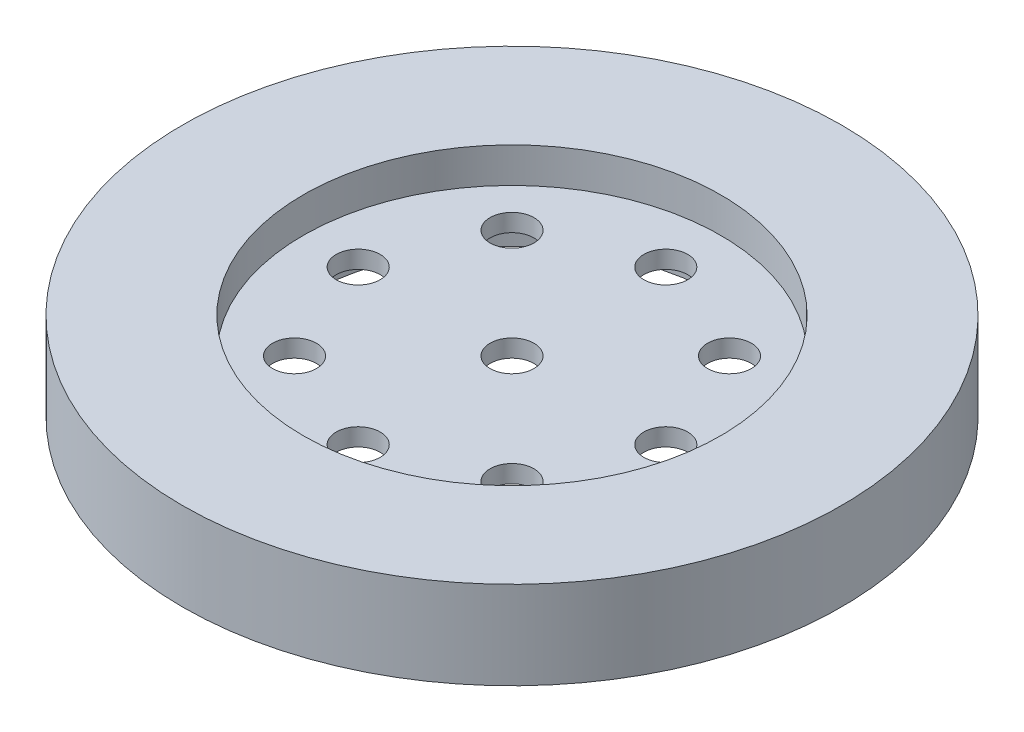
ISO-10303-21;
HEADER;
FILE_DESCRIPTION(('STEP AP214'),'2;1');
FILE_NAME('part.step','',(''),(''),'','','');
FILE_SCHEMA(('AUTOMOTIVE_DESIGN { 1 0 10303 214 1 1 1 1 }'));
ENDSEC;
DATA;
#1=APPLICATION_CONTEXT('core data for automotive mechanical design processes');
#2=APPLICATION_PROTOCOL_DEFINITION('international standard','automotive_design',2000,#1);
#3=PRODUCT_CONTEXT('',#1,'mechanical');
#4=PRODUCT('Part','Part','',(#3));
#5=PRODUCT_RELATED_PRODUCT_CATEGORY('part','',(#4));
#6=PRODUCT_DEFINITION_FORMATION('','',#4);
#7=PRODUCT_DEFINITION_CONTEXT('part definition',#1,'design');
#8=PRODUCT_DEFINITION('design','',#6,#7);
#9=PRODUCT_DEFINITION_SHAPE('','',#8);
#10=(LENGTH_UNIT() NAMED_UNIT(*) SI_UNIT(.MILLI.,.METRE.));
#11=(NAMED_UNIT(*) PLANE_ANGLE_UNIT() SI_UNIT($,.RADIAN.));
#12=(NAMED_UNIT(*) SI_UNIT($,.STERADIAN.) SOLID_ANGLE_UNIT());
#13=UNCERTAINTY_MEASURE_WITH_UNIT(LENGTH_MEASURE(1.E-05),#10,'distance_accuracy_value','');
#14=(GEOMETRIC_REPRESENTATION_CONTEXT(3) GLOBAL_UNCERTAINTY_ASSIGNED_CONTEXT((#13)) GLOBAL_UNIT_ASSIGNED_CONTEXT((#10,
#11,#12)) REPRESENTATION_CONTEXT('',''));
#15=CARTESIAN_POINT('',(0.,0.,0.));
#16=DIRECTION('',(0.,0.,1.));
#17=DIRECTION('',(1.,0.,0.));
#18=AXIS2_PLACEMENT_3D('',#15,#16,#17);
#19=CARTESIAN_POINT('',(0.,0.,0.));
#20=DIRECTION('',(0.,1.,0.));
#21=DIRECTION('',(0.,0.,1.));
#22=AXIS2_PLACEMENT_3D('',#19,#20,#21);
#23=CYLINDRICAL_SURFACE('',#22,5.);
#24=CARTESIAN_POINT('',(0.,12.,0.));
#25=DIRECTION('',(0.,1.,0.));
#26=DIRECTION('',(0.,0.,1.));
#27=AXIS2_PLACEMENT_3D('',#24,#25,#26);
#28=CIRCLE('',#27,5.);
#29=CARTESIAN_POINT('',(0.,12.,5.));
#30=VERTEX_POINT('',#29);
#31=EDGE_CURVE('E53',#30,#30,#28,.T.);
#32=ORIENTED_EDGE('',*,*,#31,.T.);
#33=EDGE_LOOP('',(#32));
#34=FACE_BOUND('',#33,.T.);
#35=CARTESIAN_POINT('',(0.,8.,0.));
#36=DIRECTION('',(0.,-1.,0.));
#37=DIRECTION('',(0.,0.,-1.));
#38=AXIS2_PLACEMENT_3D('',#35,#36,#37);
#39=CIRCLE('',#38,5.);
#40=CARTESIAN_POINT('',(0.,8.,-5.));
#41=VERTEX_POINT('',#40);
#42=EDGE_CURVE('E50',#41,#41,#39,.F.);
#43=ORIENTED_EDGE('',*,*,#42,.F.);
#44=EDGE_LOOP('',(#43));
#45=FACE_BOUND('',#44,.T.);
#46=ADVANCED_FACE('F31',(#34,#45),#23,.F.);
#47=CARTESIAN_POINT('',(0.,20.,0.));
#48=DIRECTION('',(0.,1.,0.));
#49=DIRECTION('',(0.,0.,1.));
#50=AXIS2_PLACEMENT_3D('',#47,#48,#49);
#51=PLANE('',#50);
#52=CARTESIAN_POINT('',(0.,20.,0.));
#53=DIRECTION('',(0.,1.,0.));
#54=DIRECTION('',(0.,0.,1.));
#55=AXIS2_PLACEMENT_3D('',#52,#53,#54);
#56=CIRCLE('',#55,47.5);
#57=CARTESIAN_POINT('',(0.,20.,47.5));
#58=VERTEX_POINT('',#57);
#59=EDGE_CURVE('E47',#58,#58,#56,.T.);
#60=ORIENTED_EDGE('',*,*,#59,.F.);
#61=EDGE_LOOP('',(#60));
#62=FACE_BOUND('',#61,.T.);
#63=CARTESIAN_POINT('',(0.,20.,0.));
#64=DIRECTION('',(0.,1.,0.));
#65=DIRECTION('',(0.,0.,1.));
#66=AXIS2_PLACEMENT_3D('',#63,#64,#65);
#67=CIRCLE('',#66,75.);
#68=CARTESIAN_POINT('',(0.,20.,75.));
#69=VERTEX_POINT('',#68);
#70=EDGE_CURVE('E10',#69,#69,#67,.T.);
#71=ORIENTED_EDGE('',*,*,#70,.T.);
#72=EDGE_LOOP('',(#71));
#73=FACE_BOUND('',#72,.T.);
#74=ADVANCED_FACE('F117',(#62,#73),#51,.T.);
#75=CARTESIAN_POINT('',(0.,0.,0.));
#76=DIRECTION('',(0.,1.,0.));
#77=DIRECTION('',(0.,0.,1.));
#78=AXIS2_PLACEMENT_3D('',#75,#76,#77);
#79=PLANE('',#78);
#80=CARTESIAN_POINT('',(0.,0.,0.));
#81=DIRECTION('',(0.,-1.,0.));
#82=DIRECTION('',(0.,0.,-1.));
#83=AXIS2_PLACEMENT_3D('',#80,#81,#82);
#84=CIRCLE('',#83,47.5);
#85=CARTESIAN_POINT('',(0.,0.,-47.5));
#86=VERTEX_POINT('',#85);
#87=EDGE_CURVE('E58',#86,#86,#84,.T.);
#88=ORIENTED_EDGE('',*,*,#87,.F.);
#89=EDGE_LOOP('',(#88));
#90=FACE_BOUND('',#89,.T.);
#91=CARTESIAN_POINT('',(0.,0.,0.));
#92=DIRECTION('',(0.,1.,0.));
#93=DIRECTION('',(0.,0.,1.));
#94=AXIS2_PLACEMENT_3D('',#91,#92,#93);
#95=CIRCLE('',#94,75.);
#96=CARTESIAN_POINT('',(0.,0.,75.));
#97=VERTEX_POINT('',#96);
#98=EDGE_CURVE('E39',#97,#97,#95,.T.);
#99=ORIENTED_EDGE('',*,*,#98,.F.);
#100=EDGE_LOOP('',(#99));
#101=FACE_BOUND('',#100,.T.);
#102=ADVANCED_FACE('F119',(#90,#101),#79,.F.);
#103=CARTESIAN_POINT('',(0.,20.,0.));
#104=DIRECTION('',(0.,-1.,0.));
#105=DIRECTION('',(0.,0.,-1.));
#106=AXIS2_PLACEMENT_3D('',#103,#104,#105);
#107=CYLINDRICAL_SURFACE('',#106,75.);
#108=ORIENTED_EDGE('',*,*,#70,.F.);
#109=EDGE_LOOP('',(#108));
#110=FACE_BOUND('',#109,.T.);
#111=ORIENTED_EDGE('',*,*,#98,.T.);
#112=EDGE_LOOP('',(#111));
#113=FACE_BOUND('',#112,.T.);
#114=ADVANCED_FACE('F33',(#110,#113),#107,.T.);
#115=CARTESIAN_POINT('',(0.,12.,0.));
#116=DIRECTION('',(0.,1.,0.));
#117=DIRECTION('',(0.,0.,1.));
#118=AXIS2_PLACEMENT_3D('',#115,#116,#117);
#119=CYLINDRICAL_SURFACE('',#118,47.5);
#120=CARTESIAN_POINT('',(0.,12.,0.));
#121=DIRECTION('',(0.,1.,0.));
#122=DIRECTION('',(0.,0.,1.));
#123=AXIS2_PLACEMENT_3D('',#120,#121,#122);
#124=CIRCLE('',#123,47.5);
#125=CARTESIAN_POINT('',(0.,12.,47.5));
#126=VERTEX_POINT('',#125);
#127=EDGE_CURVE('E44',#126,#126,#124,.T.);
#128=ORIENTED_EDGE('',*,*,#127,.F.);
#129=EDGE_LOOP('',(#128));
#130=FACE_BOUND('',#129,.T.);
#131=ORIENTED_EDGE('',*,*,#59,.T.);
#132=EDGE_LOOP('',(#131));
#133=FACE_BOUND('',#132,.T.);
#134=ADVANCED_FACE('F115',(#130,#133),#119,.F.);
#135=CARTESIAN_POINT('',(0.,12.,0.));
#136=DIRECTION('',(0.,1.,0.));
#137=DIRECTION('',(0.,0.,1.));
#138=AXIS2_PLACEMENT_3D('',#135,#136,#137);
#139=PLANE('',#138);
#140=CARTESIAN_POINT('',(-24.7487373415287,12.,-24.7487373415281));
#141=DIRECTION('',(0.,1.,0.));
#142=DIRECTION('',(0.,0.,1.));
#143=AXIS2_PLACEMENT_3D('',#140,#141,#142);
#144=CIRCLE('',#143,5.00000000000114);
#145=CARTESIAN_POINT('',(-24.7487373415287,12.,-19.748737341527));
#146=VERTEX_POINT('',#145);
#147=EDGE_CURVE('E91',#146,#146,#144,.T.);
#148=ORIENTED_EDGE('',*,*,#147,.F.);
#149=EDGE_LOOP('',(#148));
#150=FACE_BOUND('',#149,.T.);
#151=CARTESIAN_POINT('',(-34.9999999999985,12.,1.49213995743417E-12));
#152=DIRECTION('',(0.,1.,0.));
#153=DIRECTION('',(0.,0.,1.));
#154=AXIS2_PLACEMENT_3D('',#151,#152,#153);
#155=CIRCLE('',#154,5.00000000000221);
#156=CARTESIAN_POINT('',(-34.9999999999985,12.,5.00000000000371));
#157=VERTEX_POINT('',#156);
#158=EDGE_CURVE('E81',#157,#157,#155,.T.);
#159=ORIENTED_EDGE('',*,*,#158,.F.);
#160=EDGE_LOOP('',(#159));
#161=FACE_BOUND('',#160,.T.);
#162=CARTESIAN_POINT('',(-24.7487373415266,12.,24.7487373415302));
#163=DIRECTION('',(0.,1.,0.));
#164=DIRECTION('',(0.,0.,1.));
#165=AXIS2_PLACEMENT_3D('',#162,#163,#164);
#166=CIRCLE('',#165,5.00000000000303);
#167=CARTESIAN_POINT('',(-24.7487373415266,12.,29.7487373415332));
#168=VERTEX_POINT('',#167);
#169=EDGE_CURVE('E78',#168,#168,#166,.T.);
#170=ORIENTED_EDGE('',*,*,#169,.F.);
#171=EDGE_LOOP('',(#170));
#172=FACE_BOUND('',#171,.T.);
#173=CARTESIAN_POINT('',(2.9757073872743E-12,12.,35.));
#174=DIRECTION('',(0.,1.,0.));
#175=DIRECTION('',(0.,0.,1.));
#176=AXIS2_PLACEMENT_3D('',#173,#174,#175);
#177=CIRCLE('',#176,5.00000000000308);
#178=CARTESIAN_POINT('',(2.9757073872743E-12,12.,40.0000000000031));
#179=VERTEX_POINT('',#178);
#180=EDGE_CURVE('E75',#179,#179,#177,.T.);
#181=ORIENTED_EDGE('',*,*,#180,.F.);
#182=EDGE_LOOP('',(#181));
#183=FACE_BOUND('',#182,.T.);
#184=CARTESIAN_POINT('',(24.7487373415317,12.,24.7487373415281));
#185=DIRECTION('',(0.,1.,0.));
#186=DIRECTION('',(0.,0.,1.));
#187=AXIS2_PLACEMENT_3D('',#184,#185,#186);
#188=CIRCLE('',#187,5.0000000000023);
#189=CARTESIAN_POINT('',(24.7487373415317,12.,29.7487373415304));
#190=VERTEX_POINT('',#189);
#191=EDGE_CURVE('E71',#190,#190,#188,.T.);
#192=ORIENTED_EDGE('',*,*,#191,.F.);
#193=EDGE_LOOP('',(#192));
#194=FACE_BOUND('',#193,.T.);
#195=CARTESIAN_POINT('',(35.0000000000015,12.,-1.48785369363715E-12));
#196=DIRECTION('',(0.,1.,0.));
#197=DIRECTION('',(0.,0.,1.));
#198=AXIS2_PLACEMENT_3D('',#195,#196,#197);
#199=CIRCLE('',#198,5.00000000000111);
#200=CARTESIAN_POINT('',(35.0000000000015,12.,4.99999999999962));
#201=VERTEX_POINT('',#200);
#202=EDGE_CURVE('E67',#201,#201,#199,.T.);
#203=ORIENTED_EDGE('',*,*,#202,.F.);
#204=EDGE_LOOP('',(#203));
#205=FACE_BOUND('',#204,.T.);
#206=CARTESIAN_POINT('',(24.7487373415296,12.,-24.7487373415302));
#207=DIRECTION('',(0.,1.,0.));
#208=DIRECTION('',(0.,0.,1.));
#209=AXIS2_PLACEMENT_3D('',#206,#207,#208);
#210=CIRCLE('',#209,5.00000000000017);
#211=CARTESIAN_POINT('',(24.7487373415296,12.,-19.74873734153));
#212=VERTEX_POINT('',#211);
#213=EDGE_CURVE('E63',#212,#212,#210,.T.);
#214=ORIENTED_EDGE('',*,*,#213,.F.);
#215=EDGE_LOOP('',(#214));
#216=FACE_BOUND('',#215,.T.);
#217=CARTESIAN_POINT('',(0.,12.,-35.));
#218=DIRECTION('',(0.,1.,0.));
#219=DIRECTION('',(0.,0.,1.));
#220=AXIS2_PLACEMENT_3D('',#217,#218,#219);
#221=CIRCLE('',#220,5.);
#222=CARTESIAN_POINT('',(0.,12.,-30.));
#223=VERTEX_POINT('',#222);
#224=EDGE_CURVE('E59',#223,#223,#221,.T.);
#225=ORIENTED_EDGE('',*,*,#224,.F.);
#226=EDGE_LOOP('',(#225));
#227=FACE_BOUND('',#226,.T.);
#228=ORIENTED_EDGE('',*,*,#31,.F.);
#229=EDGE_LOOP('',(#228));
#230=FACE_BOUND('',#229,.T.);
#231=ORIENTED_EDGE('',*,*,#127,.T.);
#232=EDGE_LOOP('',(#231));
#233=FACE_BOUND('',#232,.T.);
#234=ADVANCED_FACE('F131',(#150,#161,#172,#183,#194,#205,#216,#227,#230,#233),#139,.T.);
#235=CARTESIAN_POINT('',(0.,8.,0.));
#236=DIRECTION('',(0.,-1.,0.));
#237=DIRECTION('',(0.,0.,-1.));
#238=AXIS2_PLACEMENT_3D('',#235,#236,#237);
#239=PLANE('',#238);
#240=CARTESIAN_POINT('',(-24.7487373415287,8.,-24.7487373415281));
#241=DIRECTION('',(0.,-1.,0.));
#242=DIRECTION('',(0.,0.,-1.));
#243=AXIS2_PLACEMENT_3D('',#240,#241,#242);
#244=CIRCLE('',#243,5.00000000000114);
#245=CARTESIAN_POINT('',(-24.7487373415287,8.,-29.7487373415292));
#246=VERTEX_POINT('',#245);
#247=EDGE_CURVE('E35',#246,#246,#244,.T.);
#248=ORIENTED_EDGE('',*,*,#247,.F.);
#249=EDGE_LOOP('',(#248));
#250=FACE_BOUND('',#249,.T.);
#251=CARTESIAN_POINT('',(-34.9999999999985,8.,1.49213995743417E-12));
#252=DIRECTION('',(0.,-1.,0.));
#253=DIRECTION('',(0.,0.,-1.));
#254=AXIS2_PLACEMENT_3D('',#251,#252,#253);
#255=CIRCLE('',#254,5.00000000000221);
#256=CARTESIAN_POINT('',(-34.9999999999985,8.,-5.00000000000072));
#257=VERTEX_POINT('',#256);
#258=EDGE_CURVE('E79',#257,#257,#255,.T.);
#259=ORIENTED_EDGE('',*,*,#258,.F.);
#260=EDGE_LOOP('',(#259));
#261=FACE_BOUND('',#260,.T.);
#262=CARTESIAN_POINT('',(-24.7487373415266,8.,24.7487373415302));
#263=DIRECTION('',(0.,-1.,0.));
#264=DIRECTION('',(0.,0.,-1.));
#265=AXIS2_PLACEMENT_3D('',#262,#263,#264);
#266=CIRCLE('',#265,5.00000000000303);
#267=CARTESIAN_POINT('',(-24.7487373415266,8.,19.7487373415272));
#268=VERTEX_POINT('',#267);
#269=EDGE_CURVE('E76',#268,#268,#266,.T.);
#270=ORIENTED_EDGE('',*,*,#269,.F.);
#271=EDGE_LOOP('',(#270));
#272=FACE_BOUND('',#271,.T.);
#273=CARTESIAN_POINT('',(2.9757073872743E-12,8.,35.));
#274=DIRECTION('',(0.,-1.,0.));
#275=DIRECTION('',(0.,0.,-1.));
#276=AXIS2_PLACEMENT_3D('',#273,#274,#275);
#277=CIRCLE('',#276,5.00000000000308);
#278=CARTESIAN_POINT('',(2.9757073872743E-12,8.,29.9999999999969));
#279=VERTEX_POINT('',#278);
#280=EDGE_CURVE('E72',#279,#279,#277,.T.);
#281=ORIENTED_EDGE('',*,*,#280,.F.);
#282=EDGE_LOOP('',(#281));
#283=FACE_BOUND('',#282,.T.);
#284=CARTESIAN_POINT('',(24.7487373415317,8.,24.7487373415281));
#285=DIRECTION('',(0.,-1.,0.));
#286=DIRECTION('',(0.,0.,-1.));
#287=AXIS2_PLACEMENT_3D('',#284,#285,#286);
#288=CIRCLE('',#287,5.0000000000023);
#289=CARTESIAN_POINT('',(24.7487373415317,8.,19.7487373415258));
#290=VERTEX_POINT('',#289);
#291=EDGE_CURVE('E68',#290,#290,#288,.T.);
#292=ORIENTED_EDGE('',*,*,#291,.F.);
#293=EDGE_LOOP('',(#292));
#294=FACE_BOUND('',#293,.T.);
#295=CARTESIAN_POINT('',(35.0000000000015,8.,-1.48785369363715E-12));
#296=DIRECTION('',(0.,-1.,0.));
#297=DIRECTION('',(0.,0.,-1.));
#298=AXIS2_PLACEMENT_3D('',#295,#296,#297);
#299=CIRCLE('',#298,5.00000000000111);
#300=CARTESIAN_POINT('',(35.0000000000015,8.,-5.00000000000259));
#301=VERTEX_POINT('',#300);
#302=EDGE_CURVE('E64',#301,#301,#299,.T.);
#303=ORIENTED_EDGE('',*,*,#302,.F.);
#304=EDGE_LOOP('',(#303));
#305=FACE_BOUND('',#304,.T.);
#306=CARTESIAN_POINT('',(24.7487373415296,8.,-24.7487373415302));
#307=DIRECTION('',(0.,-1.,0.));
#308=DIRECTION('',(0.,0.,-1.));
#309=AXIS2_PLACEMENT_3D('',#306,#307,#308);
#310=CIRCLE('',#309,5.00000000000017);
#311=CARTESIAN_POINT('',(24.7487373415296,8.,-29.7487373415304));
#312=VERTEX_POINT('',#311);
#313=EDGE_CURVE('E60',#312,#312,#310,.T.);
#314=ORIENTED_EDGE('',*,*,#313,.F.);
#315=EDGE_LOOP('',(#314));
#316=FACE_BOUND('',#315,.T.);
#317=CARTESIAN_POINT('',(0.,8.,-35.));
#318=DIRECTION('',(0.,-1.,0.));
#319=DIRECTION('',(0.,0.,-1.));
#320=AXIS2_PLACEMENT_3D('',#317,#318,#319);
#321=CIRCLE('',#320,5.);
#322=CARTESIAN_POINT('',(0.,8.,-40.));
#323=VERTEX_POINT('',#322);
#324=EDGE_CURVE('E55',#323,#323,#321,.T.);
#325=ORIENTED_EDGE('',*,*,#324,.F.);
#326=EDGE_LOOP('',(#325));
#327=FACE_BOUND('',#326,.T.);
#328=CARTESIAN_POINT('',(0.,8.,0.));
#329=DIRECTION('',(0.,-1.,0.));
#330=DIRECTION('',(0.,0.,-1.));
#331=AXIS2_PLACEMENT_3D('',#328,#329,#330);
#332=CIRCLE('',#331,47.5);
#333=CARTESIAN_POINT('',(0.,8.,-47.5));
#334=VERTEX_POINT('',#333);
#335=EDGE_CURVE('E54',#334,#334,#332,.T.);
#336=ORIENTED_EDGE('',*,*,#335,.T.);
#337=EDGE_LOOP('',(#336));
#338=FACE_BOUND('',#337,.T.);
#339=ORIENTED_EDGE('',*,*,#42,.T.);
#340=EDGE_LOOP('',(#339));
#341=FACE_BOUND('',#340,.T.);
#342=ADVANCED_FACE('F134',(#250,#261,#272,#283,#294,#305,#316,#327,#338,#341),#239,.T.);
#343=CARTESIAN_POINT('',(0.,8.,0.));
#344=DIRECTION('',(0.,-1.,0.));
#345=DIRECTION('',(0.,0.,-1.));
#346=AXIS2_PLACEMENT_3D('',#343,#344,#345);
#347=CYLINDRICAL_SURFACE('',#346,47.5);
#348=ORIENTED_EDGE('',*,*,#335,.F.);
#349=EDGE_LOOP('',(#348));
#350=FACE_BOUND('',#349,.T.);
#351=ORIENTED_EDGE('',*,*,#87,.T.);
#352=EDGE_LOOP('',(#351));
#353=FACE_BOUND('',#352,.T.);
#354=ADVANCED_FACE('F137',(#350,#353),#347,.F.);
#355=CARTESIAN_POINT('',(0.,0.,-35.));
#356=DIRECTION('',(0.,1.,0.));
#357=DIRECTION('',(0.,0.,1.));
#358=AXIS2_PLACEMENT_3D('',#355,#356,#357);
#359=CYLINDRICAL_SURFACE('',#358,5.);
#360=ORIENTED_EDGE('',*,*,#324,.T.);
#361=EDGE_LOOP('',(#360));
#362=FACE_BOUND('',#361,.T.);
#363=ORIENTED_EDGE('',*,*,#224,.T.);
#364=EDGE_LOOP('',(#363));
#365=FACE_BOUND('',#364,.T.);
#366=ADVANCED_FACE('F140',(#362,#365),#359,.F.);
#367=CARTESIAN_POINT('',(24.7487373415296,0.,-24.7487373415302));
#368=DIRECTION('',(0.,1.,0.));
#369=DIRECTION('',(0.,0.,1.));
#370=AXIS2_PLACEMENT_3D('',#367,#368,#369);
#371=CYLINDRICAL_SURFACE('',#370,5.00000000000017);
#372=ORIENTED_EDGE('',*,*,#313,.T.);
#373=EDGE_LOOP('',(#372));
#374=FACE_BOUND('',#373,.T.);
#375=ORIENTED_EDGE('',*,*,#213,.T.);
#376=EDGE_LOOP('',(#375));
#377=FACE_BOUND('',#376,.T.);
#378=ADVANCED_FACE('F147',(#374,#377),#371,.F.);
#379=CARTESIAN_POINT('',(35.0000000000015,0.,-1.48785369363715E-12));
#380=DIRECTION('',(0.,1.,0.));
#381=DIRECTION('',(0.,0.,1.));
#382=AXIS2_PLACEMENT_3D('',#379,#380,#381);
#383=CYLINDRICAL_SURFACE('',#382,5.00000000000111);
#384=ORIENTED_EDGE('',*,*,#302,.T.);
#385=EDGE_LOOP('',(#384));
#386=FACE_BOUND('',#385,.T.);
#387=ORIENTED_EDGE('',*,*,#202,.T.);
#388=EDGE_LOOP('',(#387));
#389=FACE_BOUND('',#388,.T.);
#390=ADVANCED_FACE('F151',(#386,#389),#383,.F.);
#391=CARTESIAN_POINT('',(24.7487373415317,0.,24.7487373415281));
#392=DIRECTION('',(0.,1.,0.));
#393=DIRECTION('',(0.,0.,1.));
#394=AXIS2_PLACEMENT_3D('',#391,#392,#393);
#395=CYLINDRICAL_SURFACE('',#394,5.0000000000023);
#396=ORIENTED_EDGE('',*,*,#291,.T.);
#397=EDGE_LOOP('',(#396));
#398=FACE_BOUND('',#397,.T.);
#399=ORIENTED_EDGE('',*,*,#191,.T.);
#400=EDGE_LOOP('',(#399));
#401=FACE_BOUND('',#400,.T.);
#402=ADVANCED_FACE('F155',(#398,#401),#395,.F.);
#403=CARTESIAN_POINT('',(2.9757073872743E-12,0.,35.));
#404=DIRECTION('',(0.,1.,0.));
#405=DIRECTION('',(0.,0.,1.));
#406=AXIS2_PLACEMENT_3D('',#403,#404,#405);
#407=CYLINDRICAL_SURFACE('',#406,5.00000000000308);
#408=ORIENTED_EDGE('',*,*,#280,.T.);
#409=EDGE_LOOP('',(#408));
#410=FACE_BOUND('',#409,.T.);
#411=ORIENTED_EDGE('',*,*,#180,.T.);
#412=EDGE_LOOP('',(#411));
#413=FACE_BOUND('',#412,.T.);
#414=ADVANCED_FACE('F159',(#410,#413),#407,.F.);
#415=CARTESIAN_POINT('',(-24.7487373415266,0.,24.7487373415302));
#416=DIRECTION('',(0.,1.,0.));
#417=DIRECTION('',(0.,0.,1.));
#418=AXIS2_PLACEMENT_3D('',#415,#416,#417);
#419=CYLINDRICAL_SURFACE('',#418,5.00000000000303);
#420=ORIENTED_EDGE('',*,*,#269,.T.);
#421=EDGE_LOOP('',(#420));
#422=FACE_BOUND('',#421,.T.);
#423=ORIENTED_EDGE('',*,*,#169,.T.);
#424=EDGE_LOOP('',(#423));
#425=FACE_BOUND('',#424,.T.);
#426=ADVANCED_FACE('F163',(#422,#425),#419,.F.);
#427=CARTESIAN_POINT('',(-34.9999999999985,0.,1.49213995743417E-12));
#428=DIRECTION('',(0.,1.,0.));
#429=DIRECTION('',(0.,0.,1.));
#430=AXIS2_PLACEMENT_3D('',#427,#428,#429);
#431=CYLINDRICAL_SURFACE('',#430,5.00000000000221);
#432=ORIENTED_EDGE('',*,*,#258,.T.);
#433=EDGE_LOOP('',(#432));
#434=FACE_BOUND('',#433,.T.);
#435=ORIENTED_EDGE('',*,*,#158,.T.);
#436=EDGE_LOOP('',(#435));
#437=FACE_BOUND('',#436,.T.);
#438=ADVANCED_FACE('F167',(#434,#437),#431,.F.);
#439=CARTESIAN_POINT('',(-24.7487373415287,0.,-24.7487373415281));
#440=DIRECTION('',(0.,1.,0.));
#441=DIRECTION('',(0.,0.,1.));
#442=AXIS2_PLACEMENT_3D('',#439,#440,#441);
#443=CYLINDRICAL_SURFACE('',#442,5.00000000000114);
#444=ORIENTED_EDGE('',*,*,#247,.T.);
#445=EDGE_LOOP('',(#444));
#446=FACE_BOUND('',#445,.T.);
#447=ORIENTED_EDGE('',*,*,#147,.T.);
#448=EDGE_LOOP('',(#447));
#449=FACE_BOUND('',#448,.T.);
#450=ADVANCED_FACE('F171',(#446,#449),#443,.F.);
#451=CLOSED_SHELL('',(#46,#74,#102,#114,#134,#234,#342,#354,#366,#378,#390,#402,#414,#426,#438,#450));
#452=MANIFOLD_SOLID_BREP('B2',#451);
#453=ADVANCED_BREP_SHAPE_REPRESENTATION('',(#18,#452),#14);
#454=SHAPE_DEFINITION_REPRESENTATION(#9,#453);
ENDSEC;
END-ISO-10303-21;
